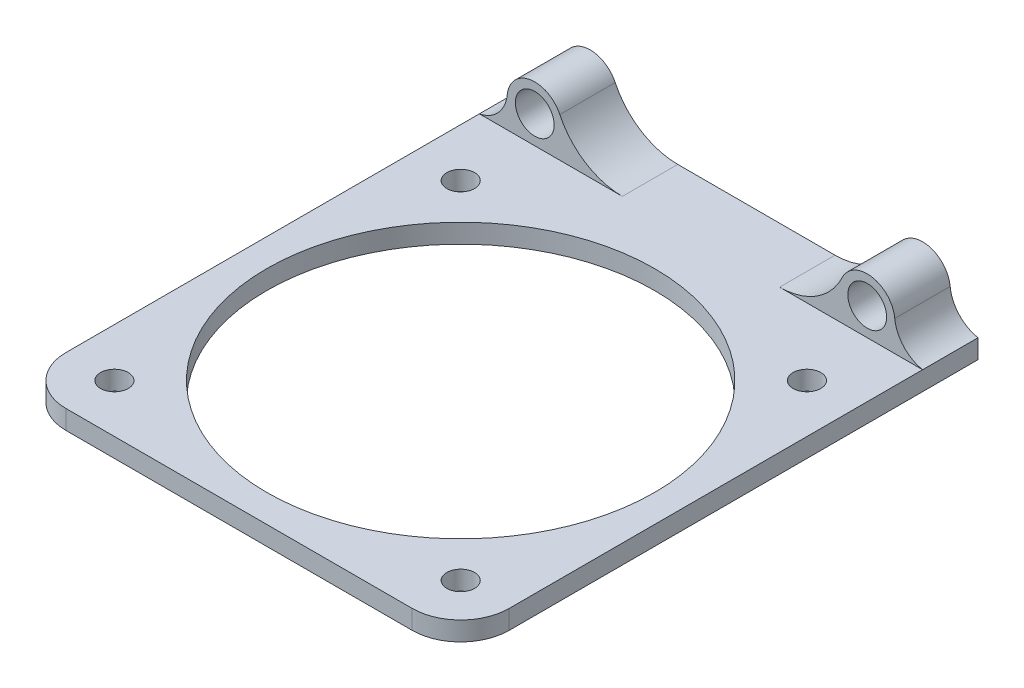
ISO-10303-21;
HEADER;
FILE_DESCRIPTION(('STEP AP214'),'2;1');
FILE_NAME('part.step','',(''),(''),'','','');
FILE_SCHEMA(('AUTOMOTIVE_DESIGN { 1 0 10303 214 1 1 1 1 }'));
ENDSEC;
DATA;
#1=APPLICATION_CONTEXT('core data for automotive mechanical design processes');
#2=APPLICATION_PROTOCOL_DEFINITION('international standard','automotive_design',2000,#1);
#3=PRODUCT_CONTEXT('',#1,'mechanical');
#4=PRODUCT('Part','Part','',(#3));
#5=PRODUCT_RELATED_PRODUCT_CATEGORY('part','',(#4));
#6=PRODUCT_DEFINITION_FORMATION('','',#4);
#7=PRODUCT_DEFINITION_CONTEXT('part definition',#1,'design');
#8=PRODUCT_DEFINITION('design','',#6,#7);
#9=PRODUCT_DEFINITION_SHAPE('','',#8);
#10=(LENGTH_UNIT() NAMED_UNIT(*) SI_UNIT(.MILLI.,.METRE.));
#11=(NAMED_UNIT(*) PLANE_ANGLE_UNIT() SI_UNIT($,.RADIAN.));
#12=(NAMED_UNIT(*) SI_UNIT($,.STERADIAN.) SOLID_ANGLE_UNIT());
#13=UNCERTAINTY_MEASURE_WITH_UNIT(LENGTH_MEASURE(1.E-05),#10,'distance_accuracy_value','');
#14=(GEOMETRIC_REPRESENTATION_CONTEXT(3) GLOBAL_UNCERTAINTY_ASSIGNED_CONTEXT((#13)) GLOBAL_UNIT_ASSIGNED_CONTEXT((#10,
#11,#12)) REPRESENTATION_CONTEXT('',''));
#15=CARTESIAN_POINT('',(0.,0.,0.));
#16=DIRECTION('',(0.,0.,1.));
#17=DIRECTION('',(1.,0.,0.));
#18=AXIS2_PLACEMENT_3D('',#15,#16,#17);
#19=CARTESIAN_POINT('',(-7.48436492767362,6.75,0.));
#20=DIRECTION('',(0.,0.,-1.));
#21=DIRECTION('',(-1.,0.,0.));
#22=AXIS2_PLACEMENT_3D('',#19,#20,#21);
#23=PLANE('',#22);
#24=CARTESIAN_POINT('',(-7.48436492767363,6.75,0.));
#25=DIRECTION('',(0.,0.,1.));
#26=DIRECTION('',(-1.,0.,0.));
#27=AXIS2_PLACEMENT_3D('',#24,#25,#26);
#28=CIRCLE('',#27,2.);
#29=CARTESIAN_POINT('',(-9.48436492767363,6.75,0.));
#30=VERTEX_POINT('',#29);
#31=EDGE_CURVE('E213',#30,#30,#28,.T.);
#32=ORIENTED_EDGE('',*,*,#31,.T.);
#33=EDGE_LOOP('',(#32));
#34=FACE_BOUND('',#33,.T.);
#35=CARTESIAN_POINT('',(-55.4843649276736,6.75,0.));
#36=DIRECTION('',(0.,0.,1.));
#37=DIRECTION('',(1.,0.,0.));
#38=AXIS2_PLACEMENT_3D('',#35,#36,#37);
#39=CIRCLE('',#38,2.);
#40=CARTESIAN_POINT('',(-53.4843649276736,6.75,0.));
#41=VERTEX_POINT('',#40);
#42=EDGE_CURVE('E293',#41,#41,#39,.T.);
#43=ORIENTED_EDGE('',*,*,#42,.T.);
#44=EDGE_LOOP('',(#43));
#45=FACE_BOUND('',#44,.T.);
#46=DIRECTION('',(0.,-1.,0.));
#47=VECTOR('',#46,1.);
#48=CARTESIAN_POINT('',(0.515635072326368,67.8193723998624,0.));
#49=LINE('',#48,#47);
#50=CARTESIAN_POINT('',(0.515635072326368,2.75,0.));
#51=VERTEX_POINT('',#50);
#52=CARTESIAN_POINT('',(0.515635072326368,0.,0.));
#53=VERTEX_POINT('',#52);
#54=EDGE_CURVE('E147',#51,#53,#49,.T.);
#55=ORIENTED_EDGE('',*,*,#54,.T.);
#56=DIRECTION('',(1.,0.,0.));
#57=VECTOR('',#56,1.);
#58=CARTESIAN_POINT('',(0.,0.,0.));
#59=LINE('',#58,#57);
#60=CARTESIAN_POINT('',(-63.4843649276736,0.,0.));
#61=VERTEX_POINT('',#60);
#62=EDGE_CURVE('E134',#61,#53,#59,.T.);
#63=ORIENTED_EDGE('',*,*,#62,.F.);
#64=DIRECTION('',(0.,-1.,0.));
#65=VECTOR('',#64,1.);
#66=CARTESIAN_POINT('',(-63.4843649276736,67.8193723998624,0.));
#67=LINE('',#66,#65);
#68=CARTESIAN_POINT('',(-63.4843649276736,2.75,0.));
#69=VERTEX_POINT('',#68);
#70=EDGE_CURVE('E145',#69,#61,#67,.T.);
#71=ORIENTED_EDGE('',*,*,#70,.F.);
#72=CARTESIAN_POINT('',(-64.4384308505274,7.6581318457076,0.));
#73=DIRECTION('',(0.,0.,-1.));
#74=DIRECTION('',(-1.,0.,0.));
#75=AXIS2_PLACEMENT_3D('',#72,#73,#74);
#76=CIRCLE('',#75,5.);
#77=CARTESIAN_POINT('',(-59.4639497822753,7.15361415364782,0.));
#78=VERTEX_POINT('',#77);
#79=EDGE_CURVE('E12',#69,#78,#76,.F.);
#80=ORIENTED_EDGE('',*,*,#79,.T.);
#81=CARTESIAN_POINT('',(-55.4843649276736,6.75,0.));
#82=DIRECTION('',(0.,0.,1.));
#83=DIRECTION('',(1.,0.,0.));
#84=AXIS2_PLACEMENT_3D('',#81,#82,#83);
#85=CIRCLE('',#84,3.99999999999999);
#86=CARTESIAN_POINT('',(-51.8703333160526,8.46428571428571,0.));
#87=VERTEX_POINT('',#86);
#88=EDGE_CURVE('E218',#87,#78,#85,.T.);
#89=ORIENTED_EDGE('',*,*,#88,.F.);
#90=CARTESIAN_POINT('',(-42.8352542870001,12.75,0.));
#91=DIRECTION('',(0.,0.,-1.));
#92=DIRECTION('',(-1.,0.,0.));
#93=AXIS2_PLACEMENT_3D('',#90,#91,#92);
#94=CIRCLE('',#93,10.);
#95=CARTESIAN_POINT('',(-42.8352542870001,2.75,0.));
#96=VERTEX_POINT('',#95);
#97=EDGE_CURVE('E265',#87,#96,#94,.F.);
#98=ORIENTED_EDGE('',*,*,#97,.T.);
#99=DIRECTION('',(-1.,0.,0.));
#100=VECTOR('',#99,1.);
#101=CARTESIAN_POINT('',(-51.4843649276736,2.75,0.));
#102=LINE('',#101,#100);
#103=CARTESIAN_POINT('',(-20.1334755683471,2.75,0.));
#104=VERTEX_POINT('',#103);
#105=EDGE_CURVE('E287',#104,#96,#102,.T.);
#106=ORIENTED_EDGE('',*,*,#105,.F.);
#107=CARTESIAN_POINT('',(-20.1334755683471,12.75,0.));
#108=DIRECTION('',(0.,0.,-1.));
#109=DIRECTION('',(-1.,0.,0.));
#110=AXIS2_PLACEMENT_3D('',#107,#108,#109);
#111=CIRCLE('',#110,10.);
#112=CARTESIAN_POINT('',(-11.0983965392946,8.46428571428571,0.));
#113=VERTEX_POINT('',#112);
#114=EDGE_CURVE('E259',#104,#113,#111,.F.);
#115=ORIENTED_EDGE('',*,*,#114,.T.);
#116=CARTESIAN_POINT('',(-7.48436492767362,6.75,0.));
#117=DIRECTION('',(0.,0.,1.));
#118=DIRECTION('',(-1.,0.,0.));
#119=AXIS2_PLACEMENT_3D('',#116,#117,#118);
#120=CIRCLE('',#119,4.);
#121=CARTESIAN_POINT('',(-3.50478007307193,7.15361415364782,0.));
#122=VERTEX_POINT('',#121);
#123=EDGE_CURVE('E290',#122,#113,#120,.T.);
#124=ORIENTED_EDGE('',*,*,#123,.F.);
#125=CARTESIAN_POINT('',(1.46970099518018,7.6581318457076,0.));
#126=DIRECTION('',(0.,0.,-1.));
#127=DIRECTION('',(-1.,0.,0.));
#128=AXIS2_PLACEMENT_3D('',#125,#126,#127);
#129=CIRCLE('',#128,5.);
#130=EDGE_CURVE('E274',#122,#51,#129,.F.);
#131=ORIENTED_EDGE('',*,*,#130,.T.);
#132=EDGE_LOOP('',(#55,#63,#71,#80,#89,#98,#106,#115,#124,#131));
#133=FACE_BOUND('',#132,.T.);
#134=ADVANCED_FACE('F34',(#34,#45,#133),#23,.T.);
#135=CARTESIAN_POINT('',(0.515635072326368,-1.25,8.));
#136=DIRECTION('',(1.,0.,0.));
#137=DIRECTION('',(0.,1.,0.));
#138=AXIS2_PLACEMENT_3D('',#135,#136,#137);
#139=PLANE('',#138);
#140=DIRECTION('',(0.,0.,1.));
#141=VECTOR('',#140,1.);
#142=CARTESIAN_POINT('',(0.515635072326368,0.,8.));
#143=LINE('',#142,#141);
#144=CARTESIAN_POINT('',(0.515635072326368,0.,67.7));
#145=VERTEX_POINT('',#144);
#146=EDGE_CURVE('E143',#53,#145,#143,.T.);
#147=ORIENTED_EDGE('',*,*,#146,.F.);
#148=ORIENTED_EDGE('',*,*,#54,.F.);
#149=DIRECTION('',(0.,0.,-1.));
#150=VECTOR('',#149,1.);
#151=CARTESIAN_POINT('',(0.515635072326367,2.75,8.));
#152=LINE('',#151,#150);
#153=CARTESIAN_POINT('',(0.515635072326367,2.75,8.));
#154=VERTEX_POINT('',#153);
#155=EDGE_CURVE('E190',#154,#51,#152,.T.);
#156=ORIENTED_EDGE('',*,*,#155,.F.);
#157=CARTESIAN_POINT('',(0.515635072326367,2.75,67.7));
#158=VERTEX_POINT('',#157);
#159=EDGE_CURVE('E191',#158,#154,#152,.T.);
#160=ORIENTED_EDGE('',*,*,#159,.F.);
#161=DIRECTION('',(0.,1.,0.));
#162=VECTOR('',#161,1.);
#163=CARTESIAN_POINT('',(0.515635072326368,-1.25,67.7));
#164=LINE('',#163,#162);
#165=EDGE_CURVE('E240',#158,#145,#164,.F.);
#166=ORIENTED_EDGE('',*,*,#165,.T.);
#167=EDGE_LOOP('',(#147,#148,#156,#160,#166));
#168=FACE_BOUND('',#167,.T.);
#169=ADVANCED_FACE('F337',(#168),#139,.T.);
#170=CARTESIAN_POINT('',(-63.4843649276736,-1.25,8.));
#171=DIRECTION('',(-1.,0.,0.));
#172=DIRECTION('',(0.,-1.,0.));
#173=AXIS2_PLACEMENT_3D('',#170,#171,#172);
#174=PLANE('',#173);
#175=ORIENTED_EDGE('',*,*,#70,.T.);
#176=DIRECTION('',(0.,0.,-1.));
#177=VECTOR('',#176,1.);
#178=CARTESIAN_POINT('',(-63.4843649276736,0.,8.));
#179=LINE('',#178,#177);
#180=CARTESIAN_POINT('',(-63.4843649276736,0.,67.7));
#181=VERTEX_POINT('',#180);
#182=EDGE_CURVE('E130',#181,#61,#179,.T.);
#183=ORIENTED_EDGE('',*,*,#182,.F.);
#184=DIRECTION('',(0.,-1.,0.));
#185=VECTOR('',#184,1.);
#186=CARTESIAN_POINT('',(-63.4843649276736,-1.25,67.7));
#187=LINE('',#186,#185);
#188=CARTESIAN_POINT('',(-63.4843649276736,2.75,67.7));
#189=VERTEX_POINT('',#188);
#190=EDGE_CURVE('E231',#181,#189,#187,.F.);
#191=ORIENTED_EDGE('',*,*,#190,.T.);
#192=DIRECTION('',(0.,0.,1.));
#193=VECTOR('',#192,1.);
#194=CARTESIAN_POINT('',(-63.4843649276736,2.75,8.));
#195=LINE('',#194,#193);
#196=CARTESIAN_POINT('',(-63.4843649276736,2.75,8.));
#197=VERTEX_POINT('',#196);
#198=EDGE_CURVE('E194',#197,#189,#195,.T.);
#199=ORIENTED_EDGE('',*,*,#198,.F.);
#200=EDGE_CURVE('E151',#69,#197,#195,.T.);
#201=ORIENTED_EDGE('',*,*,#200,.F.);
#202=EDGE_LOOP('',(#175,#183,#191,#199,#201));
#203=FACE_BOUND('',#202,.T.);
#204=ADVANCED_FACE('F149',(#203),#174,.T.);
#205=CARTESIAN_POINT('',(-6.48436492767363,0.,67.7));
#206=DIRECTION('',(0.,1.,0.));
#207=DIRECTION('',(-1.,0.,0.));
#208=AXIS2_PLACEMENT_3D('',#205,#206,#207);
#209=CYLINDRICAL_SURFACE('',#208,7.);
#210=DIRECTION('',(0.,1.,0.));
#211=VECTOR('',#210,1.);
#212=CARTESIAN_POINT('',(-6.48436492767363,0.,74.7));
#213=LINE('',#212,#211);
#214=CARTESIAN_POINT('',(-6.48436492767364,0.,74.7));
#215=VERTEX_POINT('',#214);
#216=CARTESIAN_POINT('',(-6.48436492767364,2.75,74.7));
#217=VERTEX_POINT('',#216);
#218=EDGE_CURVE('E237',#215,#217,#213,.T.);
#219=ORIENTED_EDGE('',*,*,#218,.F.);
#220=CARTESIAN_POINT('',(-6.48436492767363,0.,67.7));
#221=DIRECTION('',(0.,1.,0.));
#222=DIRECTION('',(0.,0.,1.));
#223=AXIS2_PLACEMENT_3D('',#220,#221,#222);
#224=CIRCLE('',#223,7.);
#225=EDGE_CURVE('E243',#145,#215,#224,.F.);
#226=ORIENTED_EDGE('',*,*,#225,.F.);
#227=ORIENTED_EDGE('',*,*,#165,.F.);
#228=CARTESIAN_POINT('',(-6.48436492767363,2.75,67.7));
#229=DIRECTION('',(0.,-1.,0.));
#230=DIRECTION('',(1.,0.,0.));
#231=AXIS2_PLACEMENT_3D('',#228,#229,#230);
#232=CIRCLE('',#231,7.);
#233=EDGE_CURVE('E245',#217,#158,#232,.F.);
#234=ORIENTED_EDGE('',*,*,#233,.F.);
#235=EDGE_LOOP('',(#219,#226,#227,#234));
#236=FACE_BOUND('',#235,.T.);
#237=ADVANCED_FACE('F386',(#236),#209,.T.);
#238=CARTESIAN_POINT('',(-56.4843649276736,0.,67.7));
#239=DIRECTION('',(0.,-1.,0.));
#240=DIRECTION('',(1.,0.,0.));
#241=AXIS2_PLACEMENT_3D('',#238,#239,#240);
#242=CYLINDRICAL_SURFACE('',#241,7.);
#243=DIRECTION('',(0.,-1.,0.));
#244=VECTOR('',#243,1.);
#245=CARTESIAN_POINT('',(-56.4843649276736,0.,74.7));
#246=LINE('',#245,#244);
#247=CARTESIAN_POINT('',(-56.4843649276736,2.75,74.7));
#248=VERTEX_POINT('',#247);
#249=CARTESIAN_POINT('',(-56.4843649276736,0.,74.7));
#250=VERTEX_POINT('',#249);
#251=EDGE_CURVE('E223',#248,#250,#246,.T.);
#252=ORIENTED_EDGE('',*,*,#251,.F.);
#253=CARTESIAN_POINT('',(-56.4843649276736,2.75,67.7));
#254=DIRECTION('',(0.,-1.,0.));
#255=DIRECTION('',(1.,0.,0.));
#256=AXIS2_PLACEMENT_3D('',#253,#254,#255);
#257=CIRCLE('',#256,7.);
#258=EDGE_CURVE('E233',#189,#248,#257,.F.);
#259=ORIENTED_EDGE('',*,*,#258,.F.);
#260=ORIENTED_EDGE('',*,*,#190,.F.);
#261=CARTESIAN_POINT('',(-56.4843649276736,0.,67.7));
#262=DIRECTION('',(0.,1.,0.));
#263=DIRECTION('',(0.,0.,1.));
#264=AXIS2_PLACEMENT_3D('',#261,#262,#263);
#265=CIRCLE('',#264,7.);
#266=EDGE_CURVE('E137',#250,#181,#265,.F.);
#267=ORIENTED_EDGE('',*,*,#266,.F.);
#268=EDGE_LOOP('',(#252,#259,#260,#267));
#269=FACE_BOUND('',#268,.T.);
#270=ADVANCED_FACE('F383',(#269),#242,.T.);
#271=CARTESIAN_POINT('',(-59.4843649276736,0.,8.));
#272=DIRECTION('',(0.,1.,0.));
#273=DIRECTION('',(0.,0.,1.));
#274=AXIS2_PLACEMENT_3D('',#271,#272,#273);
#275=PLANE('',#274);
#276=CARTESIAN_POINT('',(-31.4843649276736,0.,42.7));
#277=DIRECTION('',(0.,1.,0.));
#278=DIRECTION('',(0.,0.,1.));
#279=AXIS2_PLACEMENT_3D('',#276,#277,#278);
#280=CIRCLE('',#279,28.);
#281=CARTESIAN_POINT('',(-31.4843649276736,0.,70.7));
#282=VERTEX_POINT('',#281);
#283=EDGE_CURVE('E172',#282,#282,#280,.F.);
#284=ORIENTED_EDGE('',*,*,#283,.F.);
#285=EDGE_LOOP('',(#284));
#286=FACE_BOUND('',#285,.T.);
#287=ORIENTED_EDGE('',*,*,#146,.T.);
#288=ORIENTED_EDGE('',*,*,#225,.T.);
#289=DIRECTION('',(1.,0.,0.));
#290=VECTOR('',#289,1.);
#291=CARTESIAN_POINT('',(-60.4843649276736,0.,74.7));
#292=LINE('',#291,#290);
#293=EDGE_CURVE('E153',#250,#215,#292,.T.);
#294=ORIENTED_EDGE('',*,*,#293,.F.);
#295=ORIENTED_EDGE('',*,*,#266,.T.);
#296=ORIENTED_EDGE('',*,*,#182,.T.);
#297=ORIENTED_EDGE('',*,*,#62,.T.);
#298=EDGE_LOOP('',(#287,#288,#294,#295,#296,#297));
#299=FACE_BOUND('',#298,.T.);
#300=CARTESIAN_POINT('',(-6.48436492767363,0.,67.7));
#301=DIRECTION('',(0.,1.,0.));
#302=DIRECTION('',(0.,0.,1.));
#303=AXIS2_PLACEMENT_3D('',#300,#301,#302);
#304=CIRCLE('',#303,2.);
#305=CARTESIAN_POINT('',(-6.48436492767363,0.,69.7));
#306=VERTEX_POINT('',#305);
#307=EDGE_CURVE('E169',#306,#306,#304,.F.);
#308=ORIENTED_EDGE('',*,*,#307,.F.);
#309=EDGE_LOOP('',(#308));
#310=FACE_BOUND('',#309,.T.);
#311=CARTESIAN_POINT('',(-56.4843649276736,0.,67.7));
#312=DIRECTION('',(0.,1.,0.));
#313=DIRECTION('',(0.,0.,1.));
#314=AXIS2_PLACEMENT_3D('',#311,#312,#313);
#315=CIRCLE('',#314,2.);
#316=CARTESIAN_POINT('',(-56.4843649276736,0.,69.7));
#317=VERTEX_POINT('',#316);
#318=EDGE_CURVE('E163',#317,#317,#315,.F.);
#319=ORIENTED_EDGE('',*,*,#318,.F.);
#320=EDGE_LOOP('',(#319));
#321=FACE_BOUND('',#320,.T.);
#322=CARTESIAN_POINT('',(-56.4843649276736,0.,17.7));
#323=DIRECTION('',(0.,1.,0.));
#324=DIRECTION('',(0.,0.,1.));
#325=AXIS2_PLACEMENT_3D('',#322,#323,#324);
#326=CIRCLE('',#325,2.);
#327=CARTESIAN_POINT('',(-56.4843649276736,0.,19.7));
#328=VERTEX_POINT('',#327);
#329=EDGE_CURVE('E142',#328,#328,#326,.F.);
#330=ORIENTED_EDGE('',*,*,#329,.F.);
#331=EDGE_LOOP('',(#330));
#332=FACE_BOUND('',#331,.T.);
#333=CARTESIAN_POINT('',(-6.48436492767363,0.,17.7));
#334=DIRECTION('',(0.,1.,0.));
#335=DIRECTION('',(0.,0.,1.));
#336=AXIS2_PLACEMENT_3D('',#333,#334,#335);
#337=CIRCLE('',#336,2.);
#338=CARTESIAN_POINT('',(-6.48436492767363,0.,19.7));
#339=VERTEX_POINT('',#338);
#340=EDGE_CURVE('E166',#339,#339,#337,.F.);
#341=ORIENTED_EDGE('',*,*,#340,.F.);
#342=EDGE_LOOP('',(#341));
#343=FACE_BOUND('',#342,.T.);
#344=ADVANCED_FACE('F132',(#286,#299,#310,#321,#332,#343),#275,.F.);
#345=CARTESIAN_POINT('',(-7.48436492767363,6.75,8.));
#346=DIRECTION('',(0.,0.,-1.));
#347=DIRECTION('',(-1.,0.,0.));
#348=AXIS2_PLACEMENT_3D('',#345,#346,#347);
#349=CYLINDRICAL_SURFACE('',#348,2.);
#350=ORIENTED_EDGE('',*,*,#31,.F.);
#351=EDGE_LOOP('',(#350));
#352=FACE_BOUND('',#351,.T.);
#353=CARTESIAN_POINT('',(-7.48436492767363,6.75,4.));
#354=DIRECTION('',(0.,0.,1.));
#355=DIRECTION('',(1.,0.,0.));
#356=AXIS2_PLACEMENT_3D('',#353,#354,#355);
#357=CIRCLE('',#356,2.);
#358=CARTESIAN_POINT('',(-5.48436492767362,6.75,4.));
#359=VERTEX_POINT('',#358);
#360=EDGE_CURVE('E200',#359,#359,#357,.T.);
#361=ORIENTED_EDGE('',*,*,#360,.T.);
#362=EDGE_LOOP('',(#361));
#363=FACE_BOUND('',#362,.T.);
#364=ADVANCED_FACE('F303',(#352,#363),#349,.F.);
#365=CARTESIAN_POINT('',(-55.4843649276736,6.75,8.));
#366=DIRECTION('',(0.,0.,-1.));
#367=DIRECTION('',(-1.,0.,0.));
#368=AXIS2_PLACEMENT_3D('',#365,#366,#367);
#369=CYLINDRICAL_SURFACE('',#368,2.);
#370=ORIENTED_EDGE('',*,*,#42,.F.);
#371=EDGE_LOOP('',(#370));
#372=FACE_BOUND('',#371,.T.);
#373=CARTESIAN_POINT('',(-55.4843649276736,6.75,4.));
#374=DIRECTION('',(0.,0.,1.));
#375=DIRECTION('',(1.,0.,0.));
#376=AXIS2_PLACEMENT_3D('',#373,#374,#375);
#377=CIRCLE('',#376,2.);
#378=CARTESIAN_POINT('',(-53.4843649276736,6.75,4.));
#379=VERTEX_POINT('',#378);
#380=EDGE_CURVE('E206',#379,#379,#377,.T.);
#381=ORIENTED_EDGE('',*,*,#380,.T.);
#382=EDGE_LOOP('',(#381));
#383=FACE_BOUND('',#382,.T.);
#384=ADVANCED_FACE('F306',(#372,#383),#369,.F.);
#385=CARTESIAN_POINT('',(-7.48436492767362,6.75,8.));
#386=DIRECTION('',(0.,0.,-1.));
#387=DIRECTION('',(-1.,0.,0.));
#388=AXIS2_PLACEMENT_3D('',#385,#386,#387);
#389=PLANE('',#388);
#390=CARTESIAN_POINT('',(-55.4843649276736,6.75,8.));
#391=DIRECTION('',(0.,0.,1.));
#392=DIRECTION('',(1.,0.,0.));
#393=AXIS2_PLACEMENT_3D('',#390,#391,#392);
#394=CIRCLE('',#393,2.8);
#395=CARTESIAN_POINT('',(-52.6843649276736,6.75,8.));
#396=VERTEX_POINT('',#395);
#397=EDGE_CURVE('E207',#396,#396,#394,.T.);
#398=ORIENTED_EDGE('',*,*,#397,.F.);
#399=EDGE_LOOP('',(#398));
#400=FACE_BOUND('',#399,.T.);
#401=CARTESIAN_POINT('',(-55.4843649276736,6.75,8.));
#402=DIRECTION('',(0.,0.,1.));
#403=DIRECTION('',(1.,0.,0.));
#404=AXIS2_PLACEMENT_3D('',#401,#402,#403);
#405=CIRCLE('',#404,3.99999999999999);
#406=CARTESIAN_POINT('',(-51.8703333160526,8.46428571428571,8.));
#407=VERTEX_POINT('',#406);
#408=CARTESIAN_POINT('',(-59.4639497822753,7.15361415364782,8.));
#409=VERTEX_POINT('',#408);
#410=EDGE_CURVE('E224',#407,#409,#405,.T.);
#411=ORIENTED_EDGE('',*,*,#410,.T.);
#412=CARTESIAN_POINT('',(-64.4384308505274,7.6581318457076,8.));
#413=DIRECTION('',(0.,0.,-1.));
#414=DIRECTION('',(-1.,0.,0.));
#415=AXIS2_PLACEMENT_3D('',#412,#413,#414);
#416=CIRCLE('',#415,5.);
#417=EDGE_CURVE('E42',#409,#197,#416,.T.);
#418=ORIENTED_EDGE('',*,*,#417,.T.);
#419=DIRECTION('',(-1.,0.,0.));
#420=VECTOR('',#419,1.);
#421=CARTESIAN_POINT('',(-56.4828216475023,2.75,8.));
#422=LINE('',#421,#420);
#423=CARTESIAN_POINT('',(-42.8352542870001,2.75,8.));
#424=VERTEX_POINT('',#423);
#425=EDGE_CURVE('E220',#424,#197,#422,.T.);
#426=ORIENTED_EDGE('',*,*,#425,.F.);
#427=CARTESIAN_POINT('',(-42.8352542870001,12.75,8.));
#428=DIRECTION('',(0.,0.,-1.));
#429=DIRECTION('',(-1.,0.,0.));
#430=AXIS2_PLACEMENT_3D('',#427,#428,#429);
#431=CIRCLE('',#430,10.);
#432=EDGE_CURVE('E267',#424,#407,#431,.T.);
#433=ORIENTED_EDGE('',*,*,#432,.T.);
#434=EDGE_LOOP('',(#411,#418,#426,#433));
#435=FACE_BOUND('',#434,.T.);
#436=ADVANCED_FACE('F279',(#400,#435),#389,.F.);
#437=CARTESIAN_POINT('',(-7.48260825969865,6.74533569911627,8.));
#438=DIRECTION('',(0.,0.,1.));
#439=DIRECTION('',(1.,0.,0.));
#440=AXIS2_PLACEMENT_3D('',#437,#438,#439);
#441=CIRCLE('',#440,2.8);
#442=CARTESIAN_POINT('',(-4.68260825969865,6.74533569911627,8.));
#443=VERTEX_POINT('',#442);
#444=EDGE_CURVE('E196',#443,#443,#441,.T.);
#445=ORIENTED_EDGE('',*,*,#444,.F.);
#446=EDGE_LOOP('',(#445));
#447=FACE_BOUND('',#446,.T.);
#448=CARTESIAN_POINT('',(-20.1334755683471,2.75,8.));
#449=VERTEX_POINT('',#448);
#450=EDGE_CURVE('E210',#154,#449,#422,.T.);
#451=ORIENTED_EDGE('',*,*,#450,.F.);
#452=CARTESIAN_POINT('',(1.46970099518018,7.6581318457076,8.));
#453=DIRECTION('',(0.,0.,-1.));
#454=DIRECTION('',(-1.,0.,0.));
#455=AXIS2_PLACEMENT_3D('',#452,#453,#454);
#456=CIRCLE('',#455,5.);
#457=CARTESIAN_POINT('',(-3.50478007307193,7.15361415364782,8.));
#458=VERTEX_POINT('',#457);
#459=EDGE_CURVE('E276',#154,#458,#456,.T.);
#460=ORIENTED_EDGE('',*,*,#459,.T.);
#461=CARTESIAN_POINT('',(-7.48436492767362,6.75,8.));
#462=DIRECTION('',(0.,0.,1.));
#463=DIRECTION('',(-1.,0.,0.));
#464=AXIS2_PLACEMENT_3D('',#461,#462,#463);
#465=CIRCLE('',#464,4.);
#466=CARTESIAN_POINT('',(-11.0983965392946,8.46428571428571,8.));
#467=VERTEX_POINT('',#466);
#468=EDGE_CURVE('E286',#458,#467,#465,.T.);
#469=ORIENTED_EDGE('',*,*,#468,.T.);
#470=CARTESIAN_POINT('',(-20.1334755683471,12.75,8.));
#471=DIRECTION('',(0.,0.,-1.));
#472=DIRECTION('',(-1.,0.,0.));
#473=AXIS2_PLACEMENT_3D('',#470,#471,#472);
#474=CIRCLE('',#473,10.);
#475=EDGE_CURVE('E262',#467,#449,#474,.T.);
#476=ORIENTED_EDGE('',*,*,#475,.T.);
#477=EDGE_LOOP('',(#451,#460,#469,#476));
#478=FACE_BOUND('',#477,.T.);
#479=ADVANCED_FACE('F324',(#447,#478),#389,.F.);
#480=CARTESIAN_POINT('',(-7.48436492767362,6.75,8.));
#481=DIRECTION('',(0.,0.,-1.));
#482=DIRECTION('',(-1.,0.,0.));
#483=AXIS2_PLACEMENT_3D('',#480,#481,#482);
#484=CYLINDRICAL_SURFACE('',#483,4.);
#485=ORIENTED_EDGE('',*,*,#468,.F.);
#486=DIRECTION('',(0.,0.,-1.));
#487=VECTOR('',#486,1.);
#488=CARTESIAN_POINT('',(-3.50478007307193,7.15361415364782,8.));
#489=LINE('',#488,#487);
#490=EDGE_CURVE('E269',#458,#122,#489,.T.);
#491=ORIENTED_EDGE('',*,*,#490,.T.);
#492=ORIENTED_EDGE('',*,*,#123,.T.);
#493=DIRECTION('',(0.,0.,-1.));
#494=VECTOR('',#493,1.);
#495=CARTESIAN_POINT('',(-11.0983965392946,8.46428571428571,8.));
#496=LINE('',#495,#494);
#497=EDGE_CURVE('E253',#113,#467,#496,.F.);
#498=ORIENTED_EDGE('',*,*,#497,.T.);
#499=EDGE_LOOP('',(#485,#491,#492,#498));
#500=FACE_BOUND('',#499,.T.);
#501=ADVANCED_FACE('F327',(#500),#484,.T.);
#502=CARTESIAN_POINT('',(-51.4843649276736,2.75,8.));
#503=DIRECTION('',(0.,-1.,0.));
#504=DIRECTION('',(1.,0.,0.));
#505=AXIS2_PLACEMENT_3D('',#502,#503,#504);
#506=PLANE('',#505);
#507=CARTESIAN_POINT('',(-56.4843649276736,2.75,17.7));
#508=DIRECTION('',(0.,1.,0.));
#509=DIRECTION('',(-1.,0.,0.));
#510=AXIS2_PLACEMENT_3D('',#507,#508,#509);
#511=CIRCLE('',#510,2.);
#512=CARTESIAN_POINT('',(-58.4843649276736,2.75,17.7));
#513=VERTEX_POINT('',#512);
#514=EDGE_CURVE('E175',#513,#513,#511,.T.);
#515=ORIENTED_EDGE('',*,*,#514,.F.);
#516=EDGE_LOOP('',(#515));
#517=FACE_BOUND('',#516,.T.);
#518=CARTESIAN_POINT('',(-56.4843649276736,2.75,67.7));
#519=DIRECTION('',(0.,1.,0.));
#520=DIRECTION('',(1.,0.,0.));
#521=AXIS2_PLACEMENT_3D('',#518,#519,#520);
#522=CIRCLE('',#521,2.);
#523=CARTESIAN_POINT('',(-54.4843649276736,2.75,67.7));
#524=VERTEX_POINT('',#523);
#525=EDGE_CURVE('E178',#524,#524,#522,.T.);
#526=ORIENTED_EDGE('',*,*,#525,.F.);
#527=EDGE_LOOP('',(#526));
#528=FACE_BOUND('',#527,.T.);
#529=CARTESIAN_POINT('',(-6.48436492767363,2.75,17.7));
#530=DIRECTION('',(0.,1.,0.));
#531=DIRECTION('',(1.,0.,0.));
#532=AXIS2_PLACEMENT_3D('',#529,#530,#531);
#533=CIRCLE('',#532,2.);
#534=CARTESIAN_POINT('',(-4.48436492767363,2.75,17.7));
#535=VERTEX_POINT('',#534);
#536=EDGE_CURVE('E181',#535,#535,#533,.T.);
#537=ORIENTED_EDGE('',*,*,#536,.F.);
#538=EDGE_LOOP('',(#537));
#539=FACE_BOUND('',#538,.T.);
#540=CARTESIAN_POINT('',(-6.48436492767363,2.75,67.7));
#541=DIRECTION('',(0.,1.,0.));
#542=DIRECTION('',(-1.,0.,0.));
#543=AXIS2_PLACEMENT_3D('',#540,#541,#542);
#544=CIRCLE('',#543,2.);
#545=CARTESIAN_POINT('',(-8.48436492767363,2.75,67.7));
#546=VERTEX_POINT('',#545);
#547=EDGE_CURVE('E184',#546,#546,#544,.T.);
#548=ORIENTED_EDGE('',*,*,#547,.F.);
#549=EDGE_LOOP('',(#548));
#550=FACE_BOUND('',#549,.T.);
#551=ORIENTED_EDGE('',*,*,#159,.T.);
#552=ORIENTED_EDGE('',*,*,#450,.T.);
#553=DIRECTION('',(0.,0.,1.));
#554=VECTOR('',#553,1.);
#555=CARTESIAN_POINT('',(-20.1334755683471,2.75,0.));
#556=LINE('',#555,#554);
#557=EDGE_CURVE('E250',#449,#104,#556,.F.);
#558=ORIENTED_EDGE('',*,*,#557,.T.);
#559=ORIENTED_EDGE('',*,*,#105,.T.);
#560=DIRECTION('',(0.,0.,1.));
#561=VECTOR('',#560,1.);
#562=CARTESIAN_POINT('',(-42.8352542870001,2.75,8.));
#563=LINE('',#562,#561);
#564=EDGE_CURVE('E247',#96,#424,#563,.T.);
#565=ORIENTED_EDGE('',*,*,#564,.T.);
#566=ORIENTED_EDGE('',*,*,#425,.T.);
#567=ORIENTED_EDGE('',*,*,#198,.T.);
#568=ORIENTED_EDGE('',*,*,#258,.T.);
#569=DIRECTION('',(-1.,0.,0.));
#570=VECTOR('',#569,1.);
#571=CARTESIAN_POINT('',(-60.4843649276736,2.75,74.7));
#572=LINE('',#571,#570);
#573=EDGE_CURVE('E158',#217,#248,#572,.T.);
#574=ORIENTED_EDGE('',*,*,#573,.F.);
#575=ORIENTED_EDGE('',*,*,#233,.T.);
#576=EDGE_LOOP('',(#551,#552,#558,#559,#565,#566,#567,#568,#574,#575));
#577=FACE_BOUND('',#576,.T.);
#578=CARTESIAN_POINT('',(-31.4843649276736,2.75,42.7));
#579=DIRECTION('',(0.,1.,0.));
#580=DIRECTION('',(-1.,0.,0.));
#581=AXIS2_PLACEMENT_3D('',#578,#579,#580);
#582=CIRCLE('',#581,28.);
#583=CARTESIAN_POINT('',(-59.4843649276736,2.75,42.7));
#584=VERTEX_POINT('',#583);
#585=EDGE_CURVE('E187',#584,#584,#582,.T.);
#586=ORIENTED_EDGE('',*,*,#585,.F.);
#587=EDGE_LOOP('',(#586));
#588=FACE_BOUND('',#587,.T.);
#589=ADVANCED_FACE('F339',(#517,#528,#539,#550,#577,#588),#506,.F.);
#590=CARTESIAN_POINT('',(-55.4843649276736,6.75,8.));
#591=DIRECTION('',(0.,0.,-1.));
#592=DIRECTION('',(-1.,0.,0.));
#593=AXIS2_PLACEMENT_3D('',#590,#591,#592);
#594=CYLINDRICAL_SURFACE('',#593,3.99999999999999);
#595=ORIENTED_EDGE('',*,*,#88,.T.);
#596=DIRECTION('',(0.,0.,-1.));
#597=VECTOR('',#596,1.);
#598=CARTESIAN_POINT('',(-59.4639497822753,7.15361415364782,8.));
#599=LINE('',#598,#597);
#600=EDGE_CURVE('E272',#78,#409,#599,.F.);
#601=ORIENTED_EDGE('',*,*,#600,.T.);
#602=ORIENTED_EDGE('',*,*,#410,.F.);
#603=DIRECTION('',(0.,0.,-1.));
#604=VECTOR('',#603,1.);
#605=CARTESIAN_POINT('',(-51.8703333160526,8.46428571428571,8.));
#606=LINE('',#605,#604);
#607=EDGE_CURVE('E256',#407,#87,#606,.T.);
#608=ORIENTED_EDGE('',*,*,#607,.T.);
#609=EDGE_LOOP('',(#595,#601,#602,#608));
#610=FACE_BOUND('',#609,.T.);
#611=ADVANCED_FACE('F284',(#610),#594,.T.);
#612=CARTESIAN_POINT('',(-55.4843649276736,6.75,4.));
#613=DIRECTION('',(0.,0.,1.));
#614=DIRECTION('',(1.,0.,0.));
#615=AXIS2_PLACEMENT_3D('',#612,#613,#614);
#616=CYLINDRICAL_SURFACE('',#615,2.8);
#617=CARTESIAN_POINT('',(-55.4843649276736,6.75,4.));
#618=DIRECTION('',(0.,0.,1.));
#619=DIRECTION('',(1.,0.,0.));
#620=AXIS2_PLACEMENT_3D('',#617,#618,#619);
#621=CIRCLE('',#620,2.8);
#622=CARTESIAN_POINT('',(-52.6843649276736,6.75,4.));
#623=VERTEX_POINT('',#622);
#624=EDGE_CURVE('E203',#623,#623,#621,.T.);
#625=ORIENTED_EDGE('',*,*,#624,.F.);
#626=EDGE_LOOP('',(#625));
#627=FACE_BOUND('',#626,.T.);
#628=ORIENTED_EDGE('',*,*,#397,.T.);
#629=EDGE_LOOP('',(#628));
#630=FACE_BOUND('',#629,.T.);
#631=ADVANCED_FACE('F375',(#627,#630),#616,.F.);
#632=CARTESIAN_POINT('',(-55.4843649276736,6.75,4.));
#633=DIRECTION('',(0.,0.,1.));
#634=DIRECTION('',(1.,0.,0.));
#635=AXIS2_PLACEMENT_3D('',#632,#633,#634);
#636=PLANE('',#635);
#637=ORIENTED_EDGE('',*,*,#380,.F.);
#638=EDGE_LOOP('',(#637));
#639=FACE_BOUND('',#638,.T.);
#640=ORIENTED_EDGE('',*,*,#624,.T.);
#641=EDGE_LOOP('',(#640));
#642=FACE_BOUND('',#641,.T.);
#643=ADVANCED_FACE('F320',(#639,#642),#636,.T.);
#644=CARTESIAN_POINT('',(-7.48260825969865,6.74533569911627,4.));
#645=DIRECTION('',(0.,0.,1.));
#646=DIRECTION('',(1.,0.,0.));
#647=AXIS2_PLACEMENT_3D('',#644,#645,#646);
#648=CYLINDRICAL_SURFACE('',#647,2.8);
#649=CARTESIAN_POINT('',(-7.48260825969865,6.74533569911627,4.));
#650=DIRECTION('',(0.,0.,1.));
#651=DIRECTION('',(1.,0.,0.));
#652=AXIS2_PLACEMENT_3D('',#649,#650,#651);
#653=CIRCLE('',#652,2.8);
#654=CARTESIAN_POINT('',(-4.68260825969865,6.74533569911627,4.));
#655=VERTEX_POINT('',#654);
#656=EDGE_CURVE('E197',#655,#655,#653,.T.);
#657=ORIENTED_EDGE('',*,*,#656,.F.);
#658=EDGE_LOOP('',(#657));
#659=FACE_BOUND('',#658,.T.);
#660=ORIENTED_EDGE('',*,*,#444,.T.);
#661=EDGE_LOOP('',(#660));
#662=FACE_BOUND('',#661,.T.);
#663=ADVANCED_FACE('F314',(#659,#662),#648,.F.);
#664=CARTESIAN_POINT('',(-7.48260825969865,6.74533569911627,4.));
#665=DIRECTION('',(0.,0.,1.));
#666=DIRECTION('',(1.,0.,0.));
#667=AXIS2_PLACEMENT_3D('',#664,#665,#666);
#668=PLANE('',#667);
#669=ORIENTED_EDGE('',*,*,#360,.F.);
#670=EDGE_LOOP('',(#669));
#671=FACE_BOUND('',#670,.T.);
#672=ORIENTED_EDGE('',*,*,#656,.T.);
#673=EDGE_LOOP('',(#672));
#674=FACE_BOUND('',#673,.T.);
#675=ADVANCED_FACE('F310',(#671,#674),#668,.T.);
#676=CARTESIAN_POINT('',(-31.4843649276736,-1.25,42.7));
#677=DIRECTION('',(0.,1.,0.));
#678=DIRECTION('',(-1.,0.,0.));
#679=AXIS2_PLACEMENT_3D('',#676,#677,#678);
#680=CYLINDRICAL_SURFACE('',#679,28.);
#681=ORIENTED_EDGE('',*,*,#283,.T.);
#682=EDGE_LOOP('',(#681));
#683=FACE_BOUND('',#682,.T.);
#684=ORIENTED_EDGE('',*,*,#585,.T.);
#685=EDGE_LOOP('',(#684));
#686=FACE_BOUND('',#685,.T.);
#687=ADVANCED_FACE('F313',(#683,#686),#680,.F.);
#688=CARTESIAN_POINT('',(-6.48436492767363,-1.25,67.7));
#689=DIRECTION('',(0.,1.,0.));
#690=DIRECTION('',(-1.,0.,0.));
#691=AXIS2_PLACEMENT_3D('',#688,#689,#690);
#692=CYLINDRICAL_SURFACE('',#691,2.);
#693=ORIENTED_EDGE('',*,*,#307,.T.);
#694=EDGE_LOOP('',(#693));
#695=FACE_BOUND('',#694,.T.);
#696=ORIENTED_EDGE('',*,*,#547,.T.);
#697=EDGE_LOOP('',(#696));
#698=FACE_BOUND('',#697,.T.);
#699=ADVANCED_FACE('F468',(#695,#698),#692,.F.);
#700=CARTESIAN_POINT('',(-6.48436492767363,-1.25,17.7));
#701=DIRECTION('',(0.,1.,0.));
#702=DIRECTION('',(-1.,0.,0.));
#703=AXIS2_PLACEMENT_3D('',#700,#701,#702);
#704=CYLINDRICAL_SURFACE('',#703,2.);
#705=ORIENTED_EDGE('',*,*,#340,.T.);
#706=EDGE_LOOP('',(#705));
#707=FACE_BOUND('',#706,.T.);
#708=ORIENTED_EDGE('',*,*,#536,.T.);
#709=EDGE_LOOP('',(#708));
#710=FACE_BOUND('',#709,.T.);
#711=ADVANCED_FACE('F514',(#707,#710),#704,.F.);
#712=CARTESIAN_POINT('',(-56.4843649276736,-1.25,67.7));
#713=DIRECTION('',(0.,1.,0.));
#714=DIRECTION('',(-1.,0.,0.));
#715=AXIS2_PLACEMENT_3D('',#712,#713,#714);
#716=CYLINDRICAL_SURFACE('',#715,2.);
#717=ORIENTED_EDGE('',*,*,#318,.T.);
#718=EDGE_LOOP('',(#717));
#719=FACE_BOUND('',#718,.T.);
#720=ORIENTED_EDGE('',*,*,#525,.T.);
#721=EDGE_LOOP('',(#720));
#722=FACE_BOUND('',#721,.T.);
#723=ADVANCED_FACE('F503',(#719,#722),#716,.F.);
#724=CARTESIAN_POINT('',(-56.4843649276736,-1.25,17.7));
#725=DIRECTION('',(0.,1.,0.));
#726=DIRECTION('',(-1.,0.,0.));
#727=AXIS2_PLACEMENT_3D('',#724,#725,#726);
#728=CYLINDRICAL_SURFACE('',#727,2.);
#729=ORIENTED_EDGE('',*,*,#329,.T.);
#730=EDGE_LOOP('',(#729));
#731=FACE_BOUND('',#730,.T.);
#732=ORIENTED_EDGE('',*,*,#514,.T.);
#733=EDGE_LOOP('',(#732));
#734=FACE_BOUND('',#733,.T.);
#735=ADVANCED_FACE('F360',(#731,#734),#728,.F.);
#736=CARTESIAN_POINT('',(0.,0.,74.7));
#737=DIRECTION('',(0.,0.,1.));
#738=DIRECTION('',(1.,0.,0.));
#739=AXIS2_PLACEMENT_3D('',#736,#737,#738);
#740=PLANE('',#739);
#741=ORIENTED_EDGE('',*,*,#293,.T.);
#742=ORIENTED_EDGE('',*,*,#218,.T.);
#743=ORIENTED_EDGE('',*,*,#573,.T.);
#744=ORIENTED_EDGE('',*,*,#251,.T.);
#745=EDGE_LOOP('',(#741,#742,#743,#744));
#746=FACE_BOUND('',#745,.T.);
#747=ADVANCED_FACE('F352',(#746),#740,.T.);
#748=CARTESIAN_POINT('',(-20.1334755683471,12.75,8.));
#749=DIRECTION('',(0.,0.,-1.));
#750=DIRECTION('',(-1.,0.,0.));
#751=AXIS2_PLACEMENT_3D('',#748,#749,#750);
#752=CYLINDRICAL_SURFACE('',#751,10.);
#753=ORIENTED_EDGE('',*,*,#475,.F.);
#754=ORIENTED_EDGE('',*,*,#497,.F.);
#755=ORIENTED_EDGE('',*,*,#114,.F.);
#756=ORIENTED_EDGE('',*,*,#557,.F.);
#757=EDGE_LOOP('',(#753,#754,#755,#756));
#758=FACE_BOUND('',#757,.T.);
#759=ADVANCED_FACE('F349',(#758),#752,.F.);
#760=CARTESIAN_POINT('',(-42.8352542870001,12.75,8.));
#761=DIRECTION('',(0.,0.,-1.));
#762=DIRECTION('',(-1.,0.,0.));
#763=AXIS2_PLACEMENT_3D('',#760,#761,#762);
#764=CYLINDRICAL_SURFACE('',#763,10.);
#765=ORIENTED_EDGE('',*,*,#432,.F.);
#766=ORIENTED_EDGE('',*,*,#564,.F.);
#767=ORIENTED_EDGE('',*,*,#97,.F.);
#768=ORIENTED_EDGE('',*,*,#607,.F.);
#769=EDGE_LOOP('',(#765,#766,#767,#768));
#770=FACE_BOUND('',#769,.T.);
#771=ADVANCED_FACE('F351',(#770),#764,.F.);
#772=CARTESIAN_POINT('',(1.46970099518018,7.6581318457076,8.));
#773=DIRECTION('',(0.,0.,1.));
#774=DIRECTION('',(1.,0.,0.));
#775=AXIS2_PLACEMENT_3D('',#772,#773,#774);
#776=CYLINDRICAL_SURFACE('',#775,5.);
#777=ORIENTED_EDGE('',*,*,#459,.F.);
#778=ORIENTED_EDGE('',*,*,#155,.T.);
#779=ORIENTED_EDGE('',*,*,#130,.F.);
#780=ORIENTED_EDGE('',*,*,#490,.F.);
#781=EDGE_LOOP('',(#777,#778,#779,#780));
#782=FACE_BOUND('',#781,.T.);
#783=ADVANCED_FACE('F344',(#782),#776,.F.);
#784=CARTESIAN_POINT('',(-64.4384308505274,7.6581318457076,8.));
#785=DIRECTION('',(0.,0.,-1.));
#786=DIRECTION('',(-1.,0.,0.));
#787=AXIS2_PLACEMENT_3D('',#784,#785,#786);
#788=CYLINDRICAL_SURFACE('',#787,5.);
#789=ORIENTED_EDGE('',*,*,#79,.F.);
#790=ORIENTED_EDGE('',*,*,#200,.T.);
#791=ORIENTED_EDGE('',*,*,#417,.F.);
#792=ORIENTED_EDGE('',*,*,#600,.F.);
#793=EDGE_LOOP('',(#789,#790,#791,#792));
#794=FACE_BOUND('',#793,.T.);
#795=ADVANCED_FACE('F36',(#794),#788,.F.);
#796=CLOSED_SHELL('',(#134,#169,#204,#237,#270,#344,#364,#384,#436,#479,#501,#589,#611,#631,
#643,#663,#675,#687,#699,#711,#723,#735,#747,#759,#771,#783,#795));
#797=MANIFOLD_SOLID_BREP('B2',#796);
#798=ADVANCED_BREP_SHAPE_REPRESENTATION('',(#18,#797),#14);
#799=SHAPE_DEFINITION_REPRESENTATION(#9,#798);
ENDSEC;
END-ISO-10303-21;
